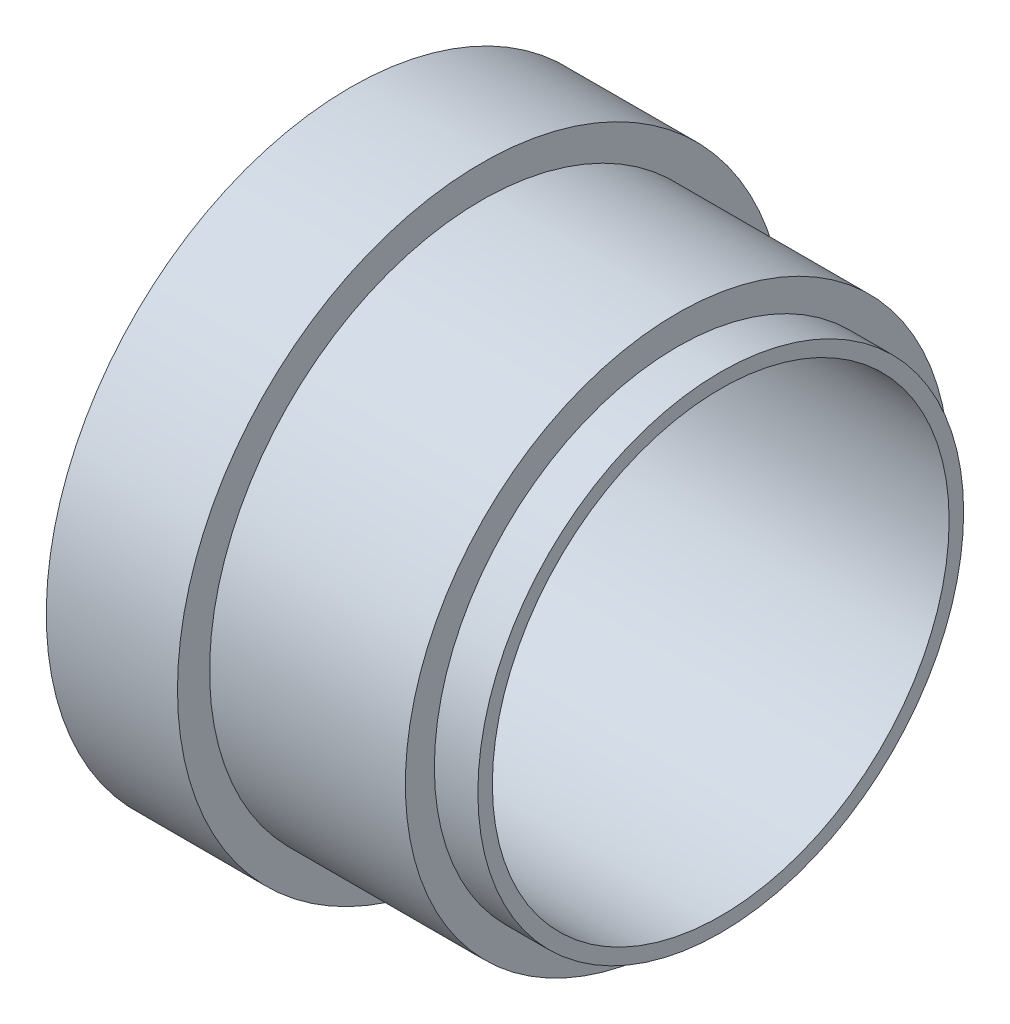
ISO-10303-21;
HEADER;
FILE_DESCRIPTION(('STEP AP214'),'2;1');
FILE_NAME('part.step','',(''),(''),'','','');
FILE_SCHEMA(('AUTOMOTIVE_DESIGN { 1 0 10303 214 1 1 1 1 }'));
ENDSEC;
DATA;
#1=APPLICATION_CONTEXT('core data for automotive mechanical design processes');
#2=APPLICATION_PROTOCOL_DEFINITION('international standard','automotive_design',2000,#1);
#3=PRODUCT_CONTEXT('',#1,'mechanical');
#4=PRODUCT('Part','Part','',(#3));
#5=PRODUCT_RELATED_PRODUCT_CATEGORY('part','',(#4));
#6=PRODUCT_DEFINITION_FORMATION('','',#4);
#7=PRODUCT_DEFINITION_CONTEXT('part definition',#1,'design');
#8=PRODUCT_DEFINITION('design','',#6,#7);
#9=PRODUCT_DEFINITION_SHAPE('','',#8);
#10=(LENGTH_UNIT() NAMED_UNIT(*) SI_UNIT(.MILLI.,.METRE.));
#11=(NAMED_UNIT(*) PLANE_ANGLE_UNIT() SI_UNIT($,.RADIAN.));
#12=(NAMED_UNIT(*) SI_UNIT($,.STERADIAN.) SOLID_ANGLE_UNIT());
#13=UNCERTAINTY_MEASURE_WITH_UNIT(LENGTH_MEASURE(1.E-05),#10,'distance_accuracy_value','');
#14=(GEOMETRIC_REPRESENTATION_CONTEXT(3) GLOBAL_UNCERTAINTY_ASSIGNED_CONTEXT((#13)) GLOBAL_UNIT_ASSIGNED_CONTEXT((#10,
#11,#12)) REPRESENTATION_CONTEXT('',''));
#15=CARTESIAN_POINT('',(0.,0.,0.));
#16=DIRECTION('',(0.,0.,1.));
#17=DIRECTION('',(1.,0.,0.));
#18=AXIS2_PLACEMENT_3D('',#15,#16,#17);
#19=CARTESIAN_POINT('',(4.67199999999551,10.0875000000012,0.));
#20=DIRECTION('',(1.,0.,0.));
#21=DIRECTION('',(0.,0.,-1.));
#22=AXIS2_PLACEMENT_3D('',#19,#20,#21);
#23=PLANE('',#22);
#24=CARTESIAN_POINT('',(4.67199999999551,0.,0.));
#25=DIRECTION('',(1.,0.,0.));
#26=DIRECTION('',(0.,0.,-1.));
#27=AXIS2_PLACEMENT_3D('',#24,#25,#26);
#28=CIRCLE('',#27,9.52500000000094);
#29=CARTESIAN_POINT('',(4.67199999999551,0.,-9.52500000000094));
#30=VERTEX_POINT('',#29);
#31=EDGE_CURVE('E45',#30,#30,#28,.T.);
#32=ORIENTED_EDGE('',*,*,#31,.F.);
#33=EDGE_LOOP('',(#32));
#34=FACE_BOUND('',#33,.T.);
#35=CARTESIAN_POINT('',(4.67199999999551,0.,0.));
#36=DIRECTION('',(1.,0.,0.));
#37=DIRECTION('',(0.,0.,-1.));
#38=AXIS2_PLACEMENT_3D('',#35,#36,#37);
#39=CIRCLE('',#38,10.6500000000014);
#40=CARTESIAN_POINT('',(4.67199999999551,0.,-10.6500000000014));
#41=VERTEX_POINT('',#40);
#42=EDGE_CURVE('E18',#41,#41,#39,.F.);
#43=ORIENTED_EDGE('',*,*,#42,.F.);
#44=EDGE_LOOP('',(#43));
#45=FACE_BOUND('',#44,.T.);
#46=ADVANCED_FACE('F15',(#34,#45),#23,.T.);
#47=CARTESIAN_POINT('',(2.37397767569528,0.,0.));
#48=DIRECTION('',(1.,0.,0.));
#49=DIRECTION('',(0.,0.,-1.));
#50=AXIS2_PLACEMENT_3D('',#47,#48,#49);
#51=CYLINDRICAL_SURFACE('',#50,10.6500000000014);
#52=CARTESIAN_POINT('',(0.0759553524420668,0.,0.));
#53=DIRECTION('',(1.,0.,0.));
#54=DIRECTION('',(0.,1.,0.));
#55=AXIS2_PLACEMENT_3D('',#52,#53,#54);
#56=CIRCLE('',#55,10.6499999996203);
#57=CARTESIAN_POINT('',(0.0759553524420667,10.6499999996203,0.));
#58=VERTEX_POINT('',#57);
#59=EDGE_CURVE('E44',#58,#58,#56,.F.);
#60=ORIENTED_EDGE('',*,*,#59,.F.);
#61=EDGE_LOOP('',(#60));
#62=FACE_BOUND('',#61,.T.);
#63=ORIENTED_EDGE('',*,*,#42,.T.);
#64=EDGE_LOOP('',(#63));
#65=FACE_BOUND('',#64,.T.);
#66=ADVANCED_FACE('F53',(#62,#65),#51,.T.);
#67=CARTESIAN_POINT('',(8.10099999999597,0.,0.));
#68=DIRECTION('',(1.,0.,0.));
#69=DIRECTION('',(0.,0.,-1.));
#70=AXIS2_PLACEMENT_3D('',#67,#68,#69);
#71=CYLINDRICAL_SURFACE('',#70,9.52500000000094);
#72=ORIENTED_EDGE('',*,*,#31,.T.);
#73=EDGE_LOOP('',(#72));
#74=FACE_BOUND('',#73,.T.);
#75=CARTESIAN_POINT('',(11.5299999999965,0.,0.));
#76=DIRECTION('',(1.,0.,0.));
#77=DIRECTION('',(0.,0.,-1.));
#78=AXIS2_PLACEMENT_3D('',#75,#76,#77);
#79=CIRCLE('',#78,9.52500000000094);
#80=CARTESIAN_POINT('',(11.5299999999965,0.,-9.52500000000094));
#81=VERTEX_POINT('',#80);
#82=EDGE_CURVE('E42',#81,#81,#79,.T.);
#83=ORIENTED_EDGE('',*,*,#82,.F.);
#84=EDGE_LOOP('',(#83));
#85=FACE_BOUND('',#84,.T.);
#86=ADVANCED_FACE('F61',(#74,#85),#71,.T.);
#87=CARTESIAN_POINT('',(0.0759553524420665,0.,0.));
#88=DIRECTION('',(1.,0.,0.));
#89=DIRECTION('',(0.,0.,-1.));
#90=AXIS2_PLACEMENT_3D('',#87,#88,#89);
#91=CONICAL_SURFACE('',#90,10.6499999996203,1.22173047500332);
#92=CARTESIAN_POINT('',(-0.469999999999111,0.,0.));
#93=DIRECTION('',(1.,0.,0.));
#94=DIRECTION('',(0.,0.,-1.));
#95=AXIS2_PLACEMENT_3D('',#92,#93,#94);
#96=CIRCLE('',#95,9.15000000000005);
#97=CARTESIAN_POINT('',(-0.469999999999111,0.,-9.15000000000005));
#98=VERTEX_POINT('',#97);
#99=EDGE_CURVE('E41',#98,#98,#96,.T.);
#100=ORIENTED_EDGE('',*,*,#99,.T.);
#101=EDGE_LOOP('',(#100));
#102=FACE_BOUND('',#101,.T.);
#103=ORIENTED_EDGE('',*,*,#59,.T.);
#104=EDGE_LOOP('',(#103));
#105=FACE_BOUND('',#104,.T.);
#106=ADVANCED_FACE('F89',(#102,#105),#91,.T.);
#107=CARTESIAN_POINT('',(11.5299999999965,9.01700000000069,0.));
#108=DIRECTION('',(1.,0.,0.));
#109=DIRECTION('',(0.,0.,-1.));
#110=AXIS2_PLACEMENT_3D('',#107,#108,#109);
#111=PLANE('',#110);
#112=CARTESIAN_POINT('',(11.5299999999965,0.,0.));
#113=DIRECTION('',(1.,0.,0.));
#114=DIRECTION('',(0.,0.,-1.));
#115=AXIS2_PLACEMENT_3D('',#112,#113,#114);
#116=CIRCLE('',#115,8.50900000000043);
#117=CARTESIAN_POINT('',(11.5299999999965,0.,-8.50900000000043));
#118=VERTEX_POINT('',#117);
#119=EDGE_CURVE('E38',#118,#118,#116,.T.);
#120=ORIENTED_EDGE('',*,*,#119,.F.);
#121=EDGE_LOOP('',(#120));
#122=FACE_BOUND('',#121,.T.);
#123=ORIENTED_EDGE('',*,*,#82,.T.);
#124=EDGE_LOOP('',(#123));
#125=FACE_BOUND('',#124,.T.);
#126=ADVANCED_FACE('F85',(#122,#125),#111,.T.);
#127=CARTESIAN_POINT('',(-0.234999999999593,0.,0.));
#128=DIRECTION('',(1.,0.,0.));
#129=DIRECTION('',(0.,0.,-1.));
#130=AXIS2_PLACEMENT_3D('',#127,#128,#129);
#131=CYLINDRICAL_SURFACE('',#130,9.15000000000005);
#132=CARTESIAN_POINT('',(0.,0.,0.));
#133=DIRECTION('',(1.,0.,0.));
#134=DIRECTION('',(0.,0.,-1.));
#135=AXIS2_PLACEMENT_3D('',#132,#133,#134);
#136=CIRCLE('',#135,9.15000000000005);
#137=CARTESIAN_POINT('',(0.,0.,-9.15000000000005));
#138=VERTEX_POINT('',#137);
#139=EDGE_CURVE('E35',#138,#138,#136,.F.);
#140=ORIENTED_EDGE('',*,*,#139,.F.);
#141=EDGE_LOOP('',(#140));
#142=FACE_BOUND('',#141,.T.);
#143=ORIENTED_EDGE('',*,*,#99,.F.);
#144=EDGE_LOOP('',(#143));
#145=FACE_BOUND('',#144,.T.);
#146=ADVANCED_FACE('F81',(#142,#145),#131,.F.);
#147=CARTESIAN_POINT('',(12.2919999999981,0.,0.));
#148=DIRECTION('',(1.,0.,0.));
#149=DIRECTION('',(0.,0.,-1.));
#150=AXIS2_PLACEMENT_3D('',#147,#148,#149);
#151=CYLINDRICAL_SURFACE('',#150,8.50900000000043);
#152=ORIENTED_EDGE('',*,*,#119,.T.);
#153=EDGE_LOOP('',(#152));
#154=FACE_BOUND('',#153,.T.);
#155=CARTESIAN_POINT('',(13.0539999999997,0.,0.));
#156=DIRECTION('',(1.,0.,0.));
#157=DIRECTION('',(0.,0.,-1.));
#158=AXIS2_PLACEMENT_3D('',#155,#156,#157);
#159=CIRCLE('',#158,8.50900000000043);
#160=CARTESIAN_POINT('',(13.0539999999997,0.,-8.50900000000043));
#161=VERTEX_POINT('',#160);
#162=EDGE_CURVE('E27',#161,#161,#159,.T.);
#163=ORIENTED_EDGE('',*,*,#162,.F.);
#164=EDGE_LOOP('',(#163));
#165=FACE_BOUND('',#164,.T.);
#166=ADVANCED_FACE('F77',(#154,#165),#151,.T.);
#167=CARTESIAN_POINT('',(0.,8.57550000000034,0.));
#168=DIRECTION('',(-1.,0.,0.));
#169=DIRECTION('',(0.,0.,1.));
#170=AXIS2_PLACEMENT_3D('',#167,#168,#169);
#171=PLANE('',#170);
#172=CARTESIAN_POINT('',(0.,0.,0.));
#173=DIRECTION('',(1.,0.,0.));
#174=DIRECTION('',(0.,0.,-1.));
#175=AXIS2_PLACEMENT_3D('',#172,#173,#174);
#176=CIRCLE('',#175,8.00100000000064);
#177=CARTESIAN_POINT('',(0.,0.,-8.00100000000064));
#178=VERTEX_POINT('',#177);
#179=EDGE_CURVE('E22',#178,#178,#176,.T.);
#180=ORIENTED_EDGE('',*,*,#179,.T.);
#181=EDGE_LOOP('',(#180));
#182=FACE_BOUND('',#181,.T.);
#183=ORIENTED_EDGE('',*,*,#139,.T.);
#184=EDGE_LOOP('',(#183));
#185=FACE_BOUND('',#184,.T.);
#186=ADVANCED_FACE('F71',(#182,#185),#171,.T.);
#187=CARTESIAN_POINT('',(13.0539999999997,8.25500000000053,0.));
#188=DIRECTION('',(1.,0.,0.));
#189=DIRECTION('',(0.,0.,-1.));
#190=AXIS2_PLACEMENT_3D('',#187,#188,#189);
#191=PLANE('',#190);
#192=CARTESIAN_POINT('',(13.0539999999997,0.,0.));
#193=DIRECTION('',(1.,0.,0.));
#194=DIRECTION('',(0.,0.,-1.));
#195=AXIS2_PLACEMENT_3D('',#192,#193,#194);
#196=CIRCLE('',#195,8.00100000000064);
#197=CARTESIAN_POINT('',(13.0539999999997,0.,-8.00100000000064));
#198=VERTEX_POINT('',#197);
#199=EDGE_CURVE('E10',#198,#198,#196,.F.);
#200=ORIENTED_EDGE('',*,*,#199,.T.);
#201=EDGE_LOOP('',(#200));
#202=FACE_BOUND('',#201,.T.);
#203=ORIENTED_EDGE('',*,*,#162,.T.);
#204=EDGE_LOOP('',(#203));
#205=FACE_BOUND('',#204,.T.);
#206=ADVANCED_FACE('F65',(#202,#205),#191,.T.);
#207=CARTESIAN_POINT('',(6.5269999999998,0.,0.));
#208=DIRECTION('',(1.,0.,0.));
#209=DIRECTION('',(0.,0.,-1.));
#210=AXIS2_PLACEMENT_3D('',#207,#208,#209);
#211=CYLINDRICAL_SURFACE('',#210,8.00100000000064);
#212=ORIENTED_EDGE('',*,*,#199,.F.);
#213=EDGE_LOOP('',(#212));
#214=FACE_BOUND('',#213,.T.);
#215=ORIENTED_EDGE('',*,*,#179,.F.);
#216=EDGE_LOOP('',(#215));
#217=FACE_BOUND('',#216,.T.);
#218=ADVANCED_FACE('F63',(#214,#217),#211,.F.);
#219=CLOSED_SHELL('',(#46,#66,#86,#106,#126,#146,#166,#186,#206,#218));
#220=MANIFOLD_SOLID_BREP('B1',#219);
#221=ADVANCED_BREP_SHAPE_REPRESENTATION('',(#18,#220),#14);
#222=SHAPE_DEFINITION_REPRESENTATION(#9,#221);
ENDSEC;
END-ISO-10303-21;
